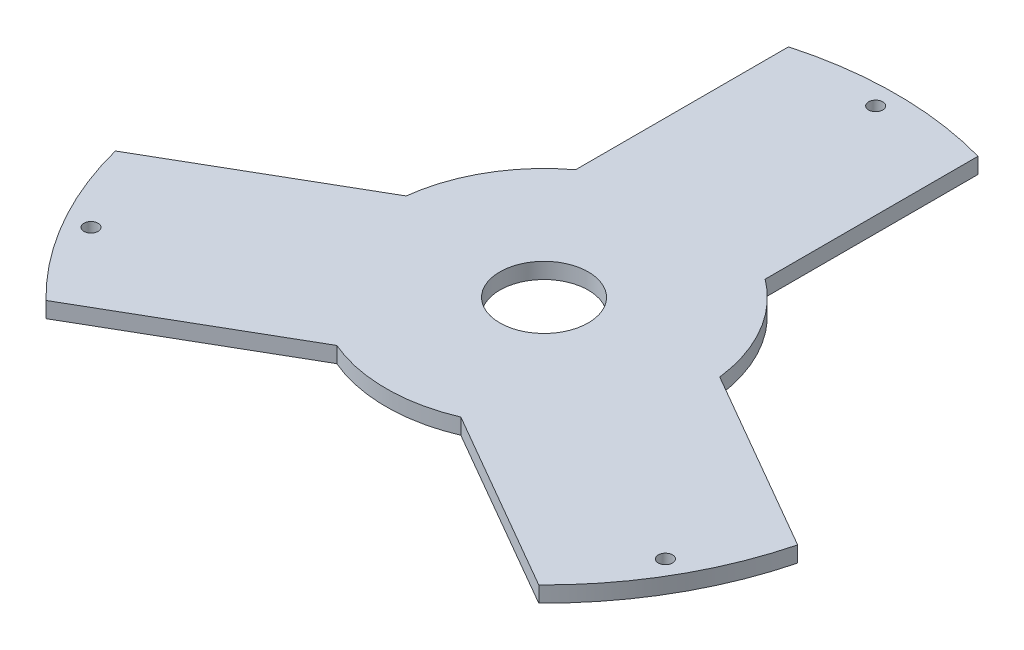
ISO-10303-21;
HEADER;
FILE_DESCRIPTION(('STEP AP214'),'2;1');
FILE_NAME('part.step','',(''),(''),'','','');
FILE_SCHEMA(('AUTOMOTIVE_DESIGN { 1 0 10303 214 1 1 1 1 }'));
ENDSEC;
DATA;
#1=APPLICATION_CONTEXT('core data for automotive mechanical design processes');
#2=APPLICATION_PROTOCOL_DEFINITION('international standard','automotive_design',2000,#1);
#3=PRODUCT_CONTEXT('',#1,'mechanical');
#4=PRODUCT('Part','Part','',(#3));
#5=PRODUCT_RELATED_PRODUCT_CATEGORY('part','',(#4));
#6=PRODUCT_DEFINITION_FORMATION('','',#4);
#7=PRODUCT_DEFINITION_CONTEXT('part definition',#1,'design');
#8=PRODUCT_DEFINITION('design','',#6,#7);
#9=PRODUCT_DEFINITION_SHAPE('','',#8);
#10=(LENGTH_UNIT() NAMED_UNIT(*) SI_UNIT(.MILLI.,.METRE.));
#11=(NAMED_UNIT(*) PLANE_ANGLE_UNIT() SI_UNIT($,.RADIAN.));
#12=(NAMED_UNIT(*) SI_UNIT($,.STERADIAN.) SOLID_ANGLE_UNIT());
#13=UNCERTAINTY_MEASURE_WITH_UNIT(LENGTH_MEASURE(1.E-05),#10,'distance_accuracy_value','');
#14=(GEOMETRIC_REPRESENTATION_CONTEXT(3) GLOBAL_UNCERTAINTY_ASSIGNED_CONTEXT((#13)) GLOBAL_UNIT_ASSIGNED_CONTEXT((#10,
#11,#12)) REPRESENTATION_CONTEXT('',''));
#15=CARTESIAN_POINT('',(0.,0.,0.));
#16=DIRECTION('',(0.,0.,1.));
#17=DIRECTION('',(1.,0.,0.));
#18=AXIS2_PLACEMENT_3D('',#15,#16,#17);
#19=CARTESIAN_POINT('',(0.,5.,0.));
#20=DIRECTION('',(0.,-1.,0.));
#21=DIRECTION('',(0.,0.,-1.));
#22=AXIS2_PLACEMENT_3D('',#19,#20,#21);
#23=CYLINDRICAL_SURFACE('',#22,111.5);
#24=CARTESIAN_POINT('',(0.,5.,0.));
#25=DIRECTION('',(0.,1.,0.));
#26=DIRECTION('',(0.,0.,1.));
#27=AXIS2_PLACEMENT_3D('',#24,#25,#26);
#28=CIRCLE('',#27,111.5);
#29=CARTESIAN_POINT('',(78.0010080590528,5.,79.6749191513338));
#30=VERTEX_POINT('',#29);
#31=CARTESIAN_POINT('',(108.001008059053,5.,27.7133949242675));
#32=VERTEX_POINT('',#31);
#33=EDGE_CURVE('E11',#30,#32,#28,.T.);
#34=ORIENTED_EDGE('',*,*,#33,.F.);
#35=DIRECTION('',(0.,1.,0.));
#36=VECTOR('',#35,1.);
#37=CARTESIAN_POINT('',(78.0010080590528,0.,79.6749191513338));
#38=LINE('',#37,#36);
#39=CARTESIAN_POINT('',(78.0010080590528,0.,79.6749191513338));
#40=VERTEX_POINT('',#39);
#41=EDGE_CURVE('E196',#40,#30,#38,.T.);
#42=ORIENTED_EDGE('',*,*,#41,.F.);
#43=CARTESIAN_POINT('',(0.,0.,0.));
#44=DIRECTION('',(0.,1.,0.));
#45=DIRECTION('',(0.,0.,1.));
#46=AXIS2_PLACEMENT_3D('',#43,#44,#45);
#47=CIRCLE('',#46,111.5);
#48=CARTESIAN_POINT('',(108.001008059053,0.,27.7133949242675));
#49=VERTEX_POINT('',#48);
#50=EDGE_CURVE('E43',#40,#49,#47,.T.);
#51=ORIENTED_EDGE('',*,*,#50,.T.);
#52=DIRECTION('',(0.,1.,0.));
#53=VECTOR('',#52,1.);
#54=CARTESIAN_POINT('',(108.001008059053,0.,27.7133949242675));
#55=LINE('',#54,#53);
#56=EDGE_CURVE('E142',#49,#32,#55,.T.);
#57=ORIENTED_EDGE('',*,*,#56,.T.);
#58=EDGE_LOOP('',(#34,#42,#51,#57));
#59=FACE_BOUND('',#58,.T.);
#60=ADVANCED_FACE('F39',(#59),#23,.T.);
#61=CARTESIAN_POINT('',(30.,5.,-107.388314075601));
#62=VERTEX_POINT('',#61);
#63=CARTESIAN_POINT('',(-30.,5.,-107.388314075601));
#64=VERTEX_POINT('',#63);
#65=EDGE_CURVE('E48',#62,#64,#28,.T.);
#66=ORIENTED_EDGE('',*,*,#65,.F.);
#67=DIRECTION('',(0.,1.,0.));
#68=VECTOR('',#67,1.);
#69=CARTESIAN_POINT('',(30.,0.,-107.388314075601));
#70=LINE('',#69,#68);
#71=CARTESIAN_POINT('',(30.,0.,-107.388314075601));
#72=VERTEX_POINT('',#71);
#73=EDGE_CURVE('E175',#72,#62,#70,.T.);
#74=ORIENTED_EDGE('',*,*,#73,.F.);
#75=CARTESIAN_POINT('',(-30.,0.,-107.388314075601));
#76=VERTEX_POINT('',#75);
#77=EDGE_CURVE('E281',#72,#76,#47,.T.);
#78=ORIENTED_EDGE('',*,*,#77,.T.);
#79=DIRECTION('',(0.,1.,0.));
#80=VECTOR('',#79,1.);
#81=CARTESIAN_POINT('',(-30.,0.,-107.388314075601));
#82=LINE('',#81,#80);
#83=EDGE_CURVE('E222',#76,#64,#82,.T.);
#84=ORIENTED_EDGE('',*,*,#83,.T.);
#85=EDGE_LOOP('',(#66,#74,#78,#84));
#86=FACE_BOUND('',#85,.T.);
#87=ADVANCED_FACE('F263',(#86),#23,.T.);
#88=CARTESIAN_POINT('',(0.,5.,0.));
#89=DIRECTION('',(0.,1.,0.));
#90=DIRECTION('',(0.,0.,1.));
#91=AXIS2_PLACEMENT_3D('',#88,#89,#90);
#92=PLANE('',#91);
#93=DIRECTION('',(-0.866025403784439,0.,-0.5));
#94=VECTOR('',#93,1.);
#95=CARTESIAN_POINT('',(19.6410161513776,5.,45.9807621135332));
#96=LINE('',#95,#94);
#97=CARTESIAN_POINT('',(19.6410161513776,5.,45.9807621135332));
#98=VERTEX_POINT('',#97);
#99=EDGE_CURVE('E182',#30,#98,#96,.T.);
#100=ORIENTED_EDGE('',*,*,#99,.F.);
#101=ORIENTED_EDGE('',*,*,#33,.T.);
#102=DIRECTION('',(0.866025403784439,0.,0.5));
#103=VECTOR('',#102,1.);
#104=CARTESIAN_POINT('',(49.6410161513775,5.,-5.98076211353317));
#105=LINE('',#104,#103);
#106=CARTESIAN_POINT('',(49.6410161513775,5.,-5.98076211353317));
#107=VERTEX_POINT('',#106);
#108=EDGE_CURVE('E163',#107,#32,#105,.T.);
#109=ORIENTED_EDGE('',*,*,#108,.F.);
#110=CARTESIAN_POINT('',(0.,5.,0.));
#111=DIRECTION('',(0.,-1.,0.));
#112=DIRECTION('',(0.,0.,1.));
#113=AXIS2_PLACEMENT_3D('',#110,#111,#112);
#114=CIRCLE('',#113,50.);
#115=CARTESIAN_POINT('',(30.,5.,-40.));
#116=VERTEX_POINT('',#115);
#117=EDGE_CURVE('E139',#116,#107,#114,.T.);
#118=ORIENTED_EDGE('',*,*,#117,.F.);
#119=DIRECTION('',(0.,0.,1.));
#120=VECTOR('',#119,1.);
#121=CARTESIAN_POINT('',(30.,5.,-40.));
#122=LINE('',#121,#120);
#123=EDGE_CURVE('E157',#62,#116,#122,.T.);
#124=ORIENTED_EDGE('',*,*,#123,.F.);
#125=ORIENTED_EDGE('',*,*,#65,.T.);
#126=DIRECTION('',(0.,0.,-1.));
#127=VECTOR('',#126,1.);
#128=CARTESIAN_POINT('',(-30.,5.,-40.));
#129=LINE('',#128,#127);
#130=CARTESIAN_POINT('',(-30.,5.,-40.));
#131=VERTEX_POINT('',#130);
#132=EDGE_CURVE('E64',#131,#64,#129,.T.);
#133=ORIENTED_EDGE('',*,*,#132,.F.);
#134=CARTESIAN_POINT('',(0.,5.,0.));
#135=DIRECTION('',(0.,-1.,0.));
#136=DIRECTION('',(0.,0.,1.));
#137=AXIS2_PLACEMENT_3D('',#134,#135,#136);
#138=CIRCLE('',#137,50.);
#139=CARTESIAN_POINT('',(-49.6410161513775,5.,-5.98076211353314));
#140=VERTEX_POINT('',#139);
#141=EDGE_CURVE('E174',#140,#131,#138,.T.);
#142=ORIENTED_EDGE('',*,*,#141,.F.);
#143=DIRECTION('',(0.866025403784438,0.,-0.5));
#144=VECTOR('',#143,1.);
#145=CARTESIAN_POINT('',(-49.6410161513775,5.,-5.98076211353314));
#146=LINE('',#145,#144);
#147=CARTESIAN_POINT('',(-108.001008059053,5.,27.7133949242676));
#148=VERTEX_POINT('',#147);
#149=EDGE_CURVE('E205',#148,#140,#146,.T.);
#150=ORIENTED_EDGE('',*,*,#149,.F.);
#151=CARTESIAN_POINT('',(-78.0010080590528,5.,79.6749191513339));
#152=VERTEX_POINT('',#151);
#153=EDGE_CURVE('E49',#148,#152,#28,.T.);
#154=ORIENTED_EDGE('',*,*,#153,.T.);
#155=DIRECTION('',(-0.866025403784438,0.,0.500000000000001));
#156=VECTOR('',#155,1.);
#157=CARTESIAN_POINT('',(-19.6410161513776,5.,45.9807621135332));
#158=LINE('',#157,#156);
#159=CARTESIAN_POINT('',(-19.6410161513776,5.,45.9807621135332));
#160=VERTEX_POINT('',#159);
#161=EDGE_CURVE('E56',#160,#152,#158,.T.);
#162=ORIENTED_EDGE('',*,*,#161,.F.);
#163=CARTESIAN_POINT('',(0.,5.,0.));
#164=DIRECTION('',(0.,-1.,0.));
#165=DIRECTION('',(0.,0.,1.));
#166=AXIS2_PLACEMENT_3D('',#163,#164,#165);
#167=CIRCLE('',#166,50.);
#168=EDGE_CURVE('E189',#98,#160,#167,.T.);
#169=ORIENTED_EDGE('',*,*,#168,.F.);
#170=EDGE_LOOP('',(#100,#101,#109,#118,#124,#125,#133,#142,#150,#154,#162,#169));
#171=FACE_BOUND('',#170,.T.);
#172=CARTESIAN_POINT('',(-90.9326673973655,5.,52.5000000000015));
#173=DIRECTION('',(0.,1.,0.));
#174=DIRECTION('',(0.,0.,1.));
#175=AXIS2_PLACEMENT_3D('',#172,#173,#174);
#176=CIRCLE('',#175,2.25);
#177=CARTESIAN_POINT('',(-90.9326673973655,5.,54.7500000000015));
#178=VERTEX_POINT('',#177);
#179=EDGE_CURVE('E219',#178,#178,#176,.T.);
#180=ORIENTED_EDGE('',*,*,#179,.F.);
#181=EDGE_LOOP('',(#180));
#182=FACE_BOUND('',#181,.T.);
#183=CARTESIAN_POINT('',(90.9326673973665,5.,52.4999999999995));
#184=DIRECTION('',(0.,1.,0.));
#185=DIRECTION('',(0.,0.,1.));
#186=AXIS2_PLACEMENT_3D('',#183,#184,#185);
#187=CIRCLE('',#186,2.25);
#188=CARTESIAN_POINT('',(90.9326673973665,5.,54.7499999999995));
#189=VERTEX_POINT('',#188);
#190=EDGE_CURVE('E230',#189,#189,#187,.T.);
#191=ORIENTED_EDGE('',*,*,#190,.F.);
#192=EDGE_LOOP('',(#191));
#193=FACE_BOUND('',#192,.T.);
#194=CARTESIAN_POINT('',(-1.0998146837693E-12,5.,-105.));
#195=DIRECTION('',(0.,1.,0.));
#196=DIRECTION('',(0.,0.,1.));
#197=AXIS2_PLACEMENT_3D('',#194,#195,#196);
#198=CIRCLE('',#197,2.25);
#199=CARTESIAN_POINT('',(-1.0998146837693E-12,5.,-102.75));
#200=VERTEX_POINT('',#199);
#201=EDGE_CURVE('E236',#200,#200,#198,.T.);
#202=ORIENTED_EDGE('',*,*,#201,.F.);
#203=EDGE_LOOP('',(#202));
#204=FACE_BOUND('',#203,.T.);
#205=CARTESIAN_POINT('',(0.,5.,0.));
#206=DIRECTION('',(0.,1.,0.));
#207=DIRECTION('',(0.,0.,1.));
#208=AXIS2_PLACEMENT_3D('',#205,#206,#207);
#209=CIRCLE('',#208,14.);
#210=CARTESIAN_POINT('',(0.,5.,14.));
#211=VERTEX_POINT('',#210);
#212=EDGE_CURVE('E243',#211,#211,#209,.T.);
#213=ORIENTED_EDGE('',*,*,#212,.F.);
#214=EDGE_LOOP('',(#213));
#215=FACE_BOUND('',#214,.T.);
#216=ADVANCED_FACE('F270',(#171,#182,#193,#204,#215),#92,.T.);
#217=CARTESIAN_POINT('',(0.,0.,0.));
#218=DIRECTION('',(0.,1.,0.));
#219=DIRECTION('',(0.,0.,1.));
#220=AXIS2_PLACEMENT_3D('',#217,#218,#219);
#221=PLANE('',#220);
#222=CARTESIAN_POINT('',(-90.9326673973655,0.,52.5000000000015));
#223=DIRECTION('',(0.,1.,0.));
#224=DIRECTION('',(0.,0.,1.));
#225=AXIS2_PLACEMENT_3D('',#222,#223,#224);
#226=CIRCLE('',#225,2.25);
#227=CARTESIAN_POINT('',(-90.9326673973655,0.,54.7500000000015));
#228=VERTEX_POINT('',#227);
#229=EDGE_CURVE('E227',#228,#228,#226,.T.);
#230=ORIENTED_EDGE('',*,*,#229,.T.);
#231=EDGE_LOOP('',(#230));
#232=FACE_BOUND('',#231,.T.);
#233=CARTESIAN_POINT('',(90.9326673973665,0.,52.4999999999995));
#234=DIRECTION('',(0.,1.,0.));
#235=DIRECTION('',(0.,0.,1.));
#236=AXIS2_PLACEMENT_3D('',#233,#234,#235);
#237=CIRCLE('',#236,2.25);
#238=CARTESIAN_POINT('',(90.9326673973665,0.,54.7499999999995));
#239=VERTEX_POINT('',#238);
#240=EDGE_CURVE('E233',#239,#239,#237,.T.);
#241=ORIENTED_EDGE('',*,*,#240,.T.);
#242=EDGE_LOOP('',(#241));
#243=FACE_BOUND('',#242,.T.);
#244=CARTESIAN_POINT('',(-1.0998146837693E-12,0.,-105.));
#245=DIRECTION('',(0.,1.,0.));
#246=DIRECTION('',(0.,0.,1.));
#247=AXIS2_PLACEMENT_3D('',#244,#245,#246);
#248=CIRCLE('',#247,2.25);
#249=CARTESIAN_POINT('',(-1.0998146837693E-12,0.,-102.75));
#250=VERTEX_POINT('',#249);
#251=EDGE_CURVE('E239',#250,#250,#248,.T.);
#252=ORIENTED_EDGE('',*,*,#251,.T.);
#253=EDGE_LOOP('',(#252));
#254=FACE_BOUND('',#253,.T.);
#255=ORIENTED_EDGE('',*,*,#50,.F.);
#256=DIRECTION('',(-0.866025403784439,0.,-0.5));
#257=VECTOR('',#256,1.);
#258=CARTESIAN_POINT('',(19.6410161513776,0.,45.9807621135332));
#259=LINE('',#258,#257);
#260=CARTESIAN_POINT('',(19.6410161513776,0.,45.9807621135332));
#261=VERTEX_POINT('',#260);
#262=EDGE_CURVE('E185',#40,#261,#259,.T.);
#263=ORIENTED_EDGE('',*,*,#262,.T.);
#264=CARTESIAN_POINT('',(0.,0.,0.));
#265=DIRECTION('',(0.,-1.,0.));
#266=DIRECTION('',(0.,0.,1.));
#267=AXIS2_PLACEMENT_3D('',#264,#265,#266);
#268=CIRCLE('',#267,50.);
#269=CARTESIAN_POINT('',(-19.6410161513776,0.,45.9807621135332));
#270=VERTEX_POINT('',#269);
#271=EDGE_CURVE('E178',#261,#270,#268,.T.);
#272=ORIENTED_EDGE('',*,*,#271,.T.);
#273=DIRECTION('',(-0.866025403784438,0.,0.500000000000001));
#274=VECTOR('',#273,1.);
#275=CARTESIAN_POINT('',(-19.6410161513776,0.,45.9807621135332));
#276=LINE('',#275,#274);
#277=CARTESIAN_POINT('',(-78.0010080590528,0.,79.6749191513339));
#278=VERTEX_POINT('',#277);
#279=EDGE_CURVE('E181',#270,#278,#276,.T.);
#280=ORIENTED_EDGE('',*,*,#279,.T.);
#281=CARTESIAN_POINT('',(-108.001008059053,0.,27.7133949242676));
#282=VERTEX_POINT('',#281);
#283=EDGE_CURVE('E246',#282,#278,#47,.T.);
#284=ORIENTED_EDGE('',*,*,#283,.F.);
#285=DIRECTION('',(0.866025403784438,0.,-0.5));
#286=VECTOR('',#285,1.);
#287=CARTESIAN_POINT('',(-49.6410161513775,0.,-5.98076211353314));
#288=LINE('',#287,#286);
#289=CARTESIAN_POINT('',(-49.6410161513775,0.,-5.98076211353314));
#290=VERTEX_POINT('',#289);
#291=EDGE_CURVE('E208',#282,#290,#288,.T.);
#292=ORIENTED_EDGE('',*,*,#291,.T.);
#293=CARTESIAN_POINT('',(0.,0.,0.));
#294=DIRECTION('',(0.,-1.,0.));
#295=DIRECTION('',(0.,0.,1.));
#296=AXIS2_PLACEMENT_3D('',#293,#294,#295);
#297=CIRCLE('',#296,50.);
#298=CARTESIAN_POINT('',(-30.,0.,-40.));
#299=VERTEX_POINT('',#298);
#300=EDGE_CURVE('E201',#290,#299,#297,.T.);
#301=ORIENTED_EDGE('',*,*,#300,.T.);
#302=DIRECTION('',(0.,0.,-1.));
#303=VECTOR('',#302,1.);
#304=CARTESIAN_POINT('',(-30.,0.,-40.));
#305=LINE('',#304,#303);
#306=EDGE_CURVE('E204',#299,#76,#305,.T.);
#307=ORIENTED_EDGE('',*,*,#306,.T.);
#308=ORIENTED_EDGE('',*,*,#77,.F.);
#309=DIRECTION('',(0.,0.,1.));
#310=VECTOR('',#309,1.);
#311=CARTESIAN_POINT('',(30.,0.,-40.));
#312=LINE('',#311,#310);
#313=CARTESIAN_POINT('',(30.,0.,-40.));
#314=VERTEX_POINT('',#313);
#315=EDGE_CURVE('E143',#72,#314,#312,.T.);
#316=ORIENTED_EDGE('',*,*,#315,.T.);
#317=CARTESIAN_POINT('',(0.,0.,0.));
#318=DIRECTION('',(0.,-1.,0.));
#319=DIRECTION('',(0.,0.,1.));
#320=AXIS2_PLACEMENT_3D('',#317,#318,#319);
#321=CIRCLE('',#320,50.);
#322=CARTESIAN_POINT('',(49.6410161513775,0.,-5.98076211353317));
#323=VERTEX_POINT('',#322);
#324=EDGE_CURVE('E136',#314,#323,#321,.T.);
#325=ORIENTED_EDGE('',*,*,#324,.T.);
#326=DIRECTION('',(0.866025403784439,0.,0.5));
#327=VECTOR('',#326,1.);
#328=CARTESIAN_POINT('',(49.6410161513775,0.,-5.98076211353317));
#329=LINE('',#328,#327);
#330=EDGE_CURVE('E146',#323,#49,#329,.T.);
#331=ORIENTED_EDGE('',*,*,#330,.T.);
#332=EDGE_LOOP('',(#255,#263,#272,#280,#284,#292,#301,#307,#308,#316,#325,#331));
#333=FACE_BOUND('',#332,.T.);
#334=CARTESIAN_POINT('',(0.,0.,0.));
#335=DIRECTION('',(0.,1.,0.));
#336=DIRECTION('',(0.,0.,1.));
#337=AXIS2_PLACEMENT_3D('',#334,#335,#336);
#338=CIRCLE('',#337,14.);
#339=CARTESIAN_POINT('',(0.,0.,14.));
#340=VERTEX_POINT('',#339);
#341=EDGE_CURVE('E242',#340,#340,#338,.T.);
#342=ORIENTED_EDGE('',*,*,#341,.T.);
#343=EDGE_LOOP('',(#342));
#344=FACE_BOUND('',#343,.T.);
#345=ADVANCED_FACE('F153',(#232,#243,#254,#333,#344),#221,.F.);
#346=ORIENTED_EDGE('',*,*,#283,.T.);
#347=DIRECTION('',(0.,1.,0.));
#348=VECTOR('',#347,1.);
#349=CARTESIAN_POINT('',(-78.0010080590528,0.,79.6749191513339));
#350=LINE('',#349,#348);
#351=EDGE_CURVE('E198',#278,#152,#350,.T.);
#352=ORIENTED_EDGE('',*,*,#351,.T.);
#353=ORIENTED_EDGE('',*,*,#153,.F.);
#354=DIRECTION('',(0.,1.,0.));
#355=VECTOR('',#354,1.);
#356=CARTESIAN_POINT('',(-108.001008059053,0.,27.7133949242676));
#357=LINE('',#356,#355);
#358=EDGE_CURVE('E220',#282,#148,#357,.T.);
#359=ORIENTED_EDGE('',*,*,#358,.F.);
#360=EDGE_LOOP('',(#346,#352,#353,#359));
#361=FACE_BOUND('',#360,.T.);
#362=ADVANCED_FACE('F41',(#361),#23,.T.);
#363=CARTESIAN_POINT('',(0.,5.,0.));
#364=DIRECTION('',(0.,-1.,0.));
#365=DIRECTION('',(0.,0.,-1.));
#366=AXIS2_PLACEMENT_3D('',#363,#364,#365);
#367=CYLINDRICAL_SURFACE('',#366,14.);
#368=ORIENTED_EDGE('',*,*,#212,.T.);
#369=EDGE_LOOP('',(#368));
#370=FACE_BOUND('',#369,.T.);
#371=ORIENTED_EDGE('',*,*,#341,.F.);
#372=EDGE_LOOP('',(#371));
#373=FACE_BOUND('',#372,.T.);
#374=ADVANCED_FACE('F250',(#370,#373),#367,.F.);
#375=CARTESIAN_POINT('',(-1.0998146837693E-12,5.,-105.));
#376=DIRECTION('',(0.,1.,0.));
#377=DIRECTION('',(0.,0.,1.));
#378=AXIS2_PLACEMENT_3D('',#375,#376,#377);
#379=CYLINDRICAL_SURFACE('',#378,2.25);
#380=ORIENTED_EDGE('',*,*,#251,.F.);
#381=EDGE_LOOP('',(#380));
#382=FACE_BOUND('',#381,.T.);
#383=ORIENTED_EDGE('',*,*,#201,.T.);
#384=EDGE_LOOP('',(#383));
#385=FACE_BOUND('',#384,.T.);
#386=ADVANCED_FACE('F252',(#382,#385),#379,.F.);
#387=CARTESIAN_POINT('',(90.9326673973665,5.,52.4999999999995));
#388=DIRECTION('',(0.,1.,0.));
#389=DIRECTION('',(0.,0.,1.));
#390=AXIS2_PLACEMENT_3D('',#387,#388,#389);
#391=CYLINDRICAL_SURFACE('',#390,2.25);
#392=ORIENTED_EDGE('',*,*,#240,.F.);
#393=EDGE_LOOP('',(#392));
#394=FACE_BOUND('',#393,.T.);
#395=ORIENTED_EDGE('',*,*,#190,.T.);
#396=EDGE_LOOP('',(#395));
#397=FACE_BOUND('',#396,.T.);
#398=ADVANCED_FACE('F259',(#394,#397),#391,.F.);
#399=CARTESIAN_POINT('',(-90.9326673973655,5.,52.5000000000015));
#400=DIRECTION('',(0.,1.,0.));
#401=DIRECTION('',(0.,0.,1.));
#402=AXIS2_PLACEMENT_3D('',#399,#400,#401);
#403=CYLINDRICAL_SURFACE('',#402,2.25);
#404=ORIENTED_EDGE('',*,*,#229,.F.);
#405=EDGE_LOOP('',(#404));
#406=FACE_BOUND('',#405,.T.);
#407=ORIENTED_EDGE('',*,*,#179,.T.);
#408=EDGE_LOOP('',(#407));
#409=FACE_BOUND('',#408,.T.);
#410=ADVANCED_FACE('F329',(#406,#409),#403,.F.);
#411=CARTESIAN_POINT('',(0.,0.,0.));
#412=DIRECTION('',(0.,1.,0.));
#413=DIRECTION('',(0.,0.,1.));
#414=AXIS2_PLACEMENT_3D('',#411,#412,#413);
#415=CYLINDRICAL_SURFACE('',#414,50.);
#416=ORIENTED_EDGE('',*,*,#141,.T.);
#417=DIRECTION('',(0.,1.,0.));
#418=VECTOR('',#417,1.);
#419=CARTESIAN_POINT('',(-30.,0.,-40.));
#420=LINE('',#419,#418);
#421=EDGE_CURVE('E211',#299,#131,#420,.T.);
#422=ORIENTED_EDGE('',*,*,#421,.F.);
#423=ORIENTED_EDGE('',*,*,#300,.F.);
#424=DIRECTION('',(0.,1.,0.));
#425=VECTOR('',#424,1.);
#426=CARTESIAN_POINT('',(-49.6410161513775,0.,-5.98076211353314));
#427=LINE('',#426,#425);
#428=EDGE_CURVE('E217',#290,#140,#427,.T.);
#429=ORIENTED_EDGE('',*,*,#428,.T.);
#430=EDGE_LOOP('',(#416,#422,#423,#429));
#431=FACE_BOUND('',#430,.T.);
#432=ADVANCED_FACE('F298',(#431),#415,.T.);
#433=CARTESIAN_POINT('',(-49.6410161513775,0.,-5.98076211353314));
#434=DIRECTION('',(0.5,0.,0.866025403784438));
#435=DIRECTION('',(0.866025403784438,0.,-0.500000000000001));
#436=AXIS2_PLACEMENT_3D('',#433,#434,#435);
#437=PLANE('',#436);
#438=ORIENTED_EDGE('',*,*,#149,.T.);
#439=ORIENTED_EDGE('',*,*,#428,.F.);
#440=ORIENTED_EDGE('',*,*,#291,.F.);
#441=ORIENTED_EDGE('',*,*,#358,.T.);
#442=EDGE_LOOP('',(#438,#439,#440,#441));
#443=FACE_BOUND('',#442,.T.);
#444=ADVANCED_FACE('F295',(#443),#437,.F.);
#445=CARTESIAN_POINT('',(-30.,0.,-40.));
#446=DIRECTION('',(1.,0.,0.));
#447=DIRECTION('',(0.,0.,-1.));
#448=AXIS2_PLACEMENT_3D('',#445,#446,#447);
#449=PLANE('',#448);
#450=ORIENTED_EDGE('',*,*,#132,.T.);
#451=ORIENTED_EDGE('',*,*,#83,.F.);
#452=ORIENTED_EDGE('',*,*,#306,.F.);
#453=ORIENTED_EDGE('',*,*,#421,.T.);
#454=EDGE_LOOP('',(#450,#451,#452,#453));
#455=FACE_BOUND('',#454,.T.);
#456=ADVANCED_FACE('F314',(#455),#449,.F.);
#457=CARTESIAN_POINT('',(0.,0.,0.));
#458=DIRECTION('',(0.,1.,0.));
#459=DIRECTION('',(0.,0.,1.));
#460=AXIS2_PLACEMENT_3D('',#457,#458,#459);
#461=CYLINDRICAL_SURFACE('',#460,50.);
#462=ORIENTED_EDGE('',*,*,#117,.T.);
#463=DIRECTION('',(0.,1.,0.));
#464=VECTOR('',#463,1.);
#465=CARTESIAN_POINT('',(49.6410161513775,0.,-5.98076211353317));
#466=LINE('',#465,#464);
#467=EDGE_CURVE('E132',#323,#107,#466,.T.);
#468=ORIENTED_EDGE('',*,*,#467,.F.);
#469=ORIENTED_EDGE('',*,*,#324,.F.);
#470=DIRECTION('',(0.,1.,0.));
#471=VECTOR('',#470,1.);
#472=CARTESIAN_POINT('',(30.,0.,-40.));
#473=LINE('',#472,#471);
#474=EDGE_CURVE('E172',#314,#116,#473,.T.);
#475=ORIENTED_EDGE('',*,*,#474,.T.);
#476=EDGE_LOOP('',(#462,#468,#469,#475));
#477=FACE_BOUND('',#476,.T.);
#478=ADVANCED_FACE('F134',(#477),#461,.T.);
#479=CARTESIAN_POINT('',(30.,0.,-40.));
#480=DIRECTION('',(-1.,0.,0.));
#481=DIRECTION('',(0.,0.,1.));
#482=AXIS2_PLACEMENT_3D('',#479,#480,#481);
#483=PLANE('',#482);
#484=ORIENTED_EDGE('',*,*,#123,.T.);
#485=ORIENTED_EDGE('',*,*,#474,.F.);
#486=ORIENTED_EDGE('',*,*,#315,.F.);
#487=ORIENTED_EDGE('',*,*,#73,.T.);
#488=EDGE_LOOP('',(#484,#485,#486,#487));
#489=FACE_BOUND('',#488,.T.);
#490=ADVANCED_FACE('F305',(#489),#483,.F.);
#491=CARTESIAN_POINT('',(49.6410161513775,0.,-5.98076211353317));
#492=DIRECTION('',(-0.5,0.,0.866025403784439));
#493=DIRECTION('',(0.866025403784439,0.,0.5));
#494=AXIS2_PLACEMENT_3D('',#491,#492,#493);
#495=PLANE('',#494);
#496=ORIENTED_EDGE('',*,*,#108,.T.);
#497=ORIENTED_EDGE('',*,*,#56,.F.);
#498=ORIENTED_EDGE('',*,*,#330,.F.);
#499=ORIENTED_EDGE('',*,*,#467,.T.);
#500=EDGE_LOOP('',(#496,#497,#498,#499));
#501=FACE_BOUND('',#500,.T.);
#502=ADVANCED_FACE('F147',(#501),#495,.F.);
#503=CARTESIAN_POINT('',(0.,0.,0.));
#504=DIRECTION('',(0.,1.,0.));
#505=DIRECTION('',(0.,0.,1.));
#506=AXIS2_PLACEMENT_3D('',#503,#504,#505);
#507=CYLINDRICAL_SURFACE('',#506,50.);
#508=ORIENTED_EDGE('',*,*,#168,.T.);
#509=DIRECTION('',(0.,1.,0.));
#510=VECTOR('',#509,1.);
#511=CARTESIAN_POINT('',(-19.6410161513776,0.,45.9807621135332));
#512=LINE('',#511,#510);
#513=EDGE_CURVE('E188',#270,#160,#512,.T.);
#514=ORIENTED_EDGE('',*,*,#513,.F.);
#515=ORIENTED_EDGE('',*,*,#271,.F.);
#516=DIRECTION('',(0.,1.,0.));
#517=VECTOR('',#516,1.);
#518=CARTESIAN_POINT('',(19.6410161513776,0.,45.9807621135332));
#519=LINE('',#518,#517);
#520=EDGE_CURVE('E170',#261,#98,#519,.T.);
#521=ORIENTED_EDGE('',*,*,#520,.T.);
#522=EDGE_LOOP('',(#508,#514,#515,#521));
#523=FACE_BOUND('',#522,.T.);
#524=ADVANCED_FACE('F291',(#523),#507,.T.);
#525=CARTESIAN_POINT('',(19.6410161513776,0.,45.9807621135332));
#526=DIRECTION('',(0.5,0.,-0.866025403784439));
#527=DIRECTION('',(-0.866025403784439,0.,-0.5));
#528=AXIS2_PLACEMENT_3D('',#525,#526,#527);
#529=PLANE('',#528);
#530=ORIENTED_EDGE('',*,*,#99,.T.);
#531=ORIENTED_EDGE('',*,*,#520,.F.);
#532=ORIENTED_EDGE('',*,*,#262,.F.);
#533=ORIENTED_EDGE('',*,*,#41,.T.);
#534=EDGE_LOOP('',(#530,#531,#532,#533));
#535=FACE_BOUND('',#534,.T.);
#536=ADVANCED_FACE('F279',(#535),#529,.F.);
#537=CARTESIAN_POINT('',(-19.6410161513776,0.,45.9807621135332));
#538=DIRECTION('',(-0.500000000000001,0.,-0.866025403784438));
#539=DIRECTION('',(-0.866025403784438,0.,0.500000000000001));
#540=AXIS2_PLACEMENT_3D('',#537,#538,#539);
#541=PLANE('',#540);
#542=ORIENTED_EDGE('',*,*,#161,.T.);
#543=ORIENTED_EDGE('',*,*,#351,.F.);
#544=ORIENTED_EDGE('',*,*,#279,.F.);
#545=ORIENTED_EDGE('',*,*,#513,.T.);
#546=EDGE_LOOP('',(#542,#543,#544,#545));
#547=FACE_BOUND('',#546,.T.);
#548=ADVANCED_FACE('F289',(#547),#541,.F.);
#549=CLOSED_SHELL('',(#60,#87,#216,#345,#362,#374,#386,#398,#410,#432,#444,#456,#478,#490,#502,
#524,#536,#548));
#550=MANIFOLD_SOLID_BREP('B2',#549);
#551=ADVANCED_BREP_SHAPE_REPRESENTATION('',(#18,#550),#14);
#552=SHAPE_DEFINITION_REPRESENTATION(#9,#551);
ENDSEC;
END-ISO-10303-21;
